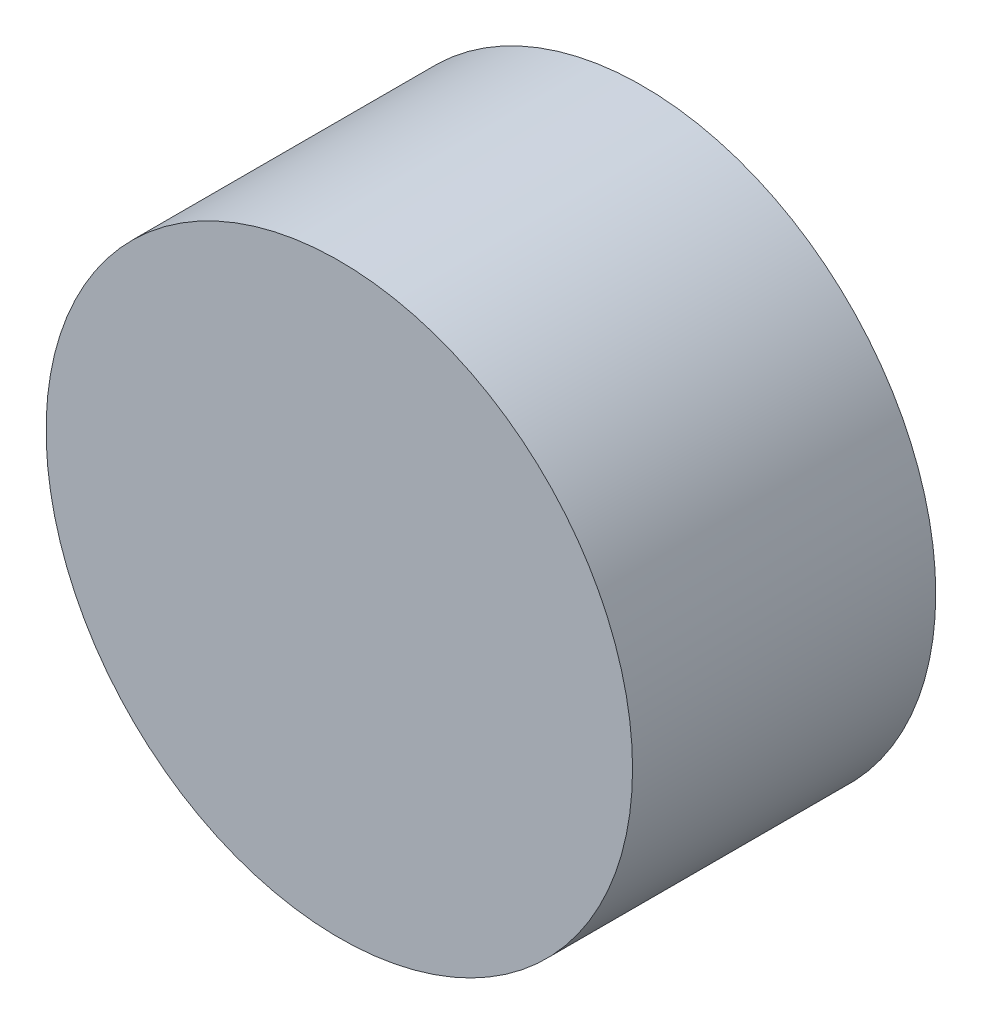
ISO-10303-21;
HEADER;
FILE_DESCRIPTION(('STEP AP214'),'2;1');
FILE_NAME('part.step','',(''),(''),'','','');
FILE_SCHEMA(('AUTOMOTIVE_DESIGN { 1 0 10303 214 1 1 1 1 }'));
ENDSEC;
DATA;
#1=APPLICATION_CONTEXT('core data for automotive mechanical design processes');
#2=APPLICATION_PROTOCOL_DEFINITION('international standard','automotive_design',2000,#1);
#3=PRODUCT_CONTEXT('',#1,'mechanical');
#4=PRODUCT('Part','Part','',(#3));
#5=PRODUCT_RELATED_PRODUCT_CATEGORY('part','',(#4));
#6=PRODUCT_DEFINITION_FORMATION('','',#4);
#7=PRODUCT_DEFINITION_CONTEXT('part definition',#1,'design');
#8=PRODUCT_DEFINITION('design','',#6,#7);
#9=PRODUCT_DEFINITION_SHAPE('','',#8);
#10=(LENGTH_UNIT() NAMED_UNIT(*) SI_UNIT(.MILLI.,.METRE.));
#11=(NAMED_UNIT(*) PLANE_ANGLE_UNIT() SI_UNIT($,.RADIAN.));
#12=(NAMED_UNIT(*) SI_UNIT($,.STERADIAN.) SOLID_ANGLE_UNIT());
#13=UNCERTAINTY_MEASURE_WITH_UNIT(LENGTH_MEASURE(1.E-05),#10,'distance_accuracy_value','');
#14=(GEOMETRIC_REPRESENTATION_CONTEXT(3) GLOBAL_UNCERTAINTY_ASSIGNED_CONTEXT((#13)) GLOBAL_UNIT_ASSIGNED_CONTEXT((#10,
#11,#12)) REPRESENTATION_CONTEXT('',''));
#15=CARTESIAN_POINT('',(0.,0.,0.));
#16=DIRECTION('',(0.,0.,1.));
#17=DIRECTION('',(1.,0.,0.));
#18=AXIS2_PLACEMENT_3D('',#15,#16,#17);
#19=CARTESIAN_POINT('',(0.,0.,15.25));
#20=DIRECTION('',(0.,0.,-1.));
#21=DIRECTION('',(-1.,0.,0.));
#22=AXIS2_PLACEMENT_3D('',#19,#20,#21);
#23=CYLINDRICAL_SURFACE('',#22,14.75);
#24=CARTESIAN_POINT('',(0.,0.,15.25));
#25=DIRECTION('',(0.,0.,1.));
#26=DIRECTION('',(1.,0.,0.));
#27=AXIS2_PLACEMENT_3D('',#24,#25,#26);
#28=CIRCLE('',#27,14.75);
#29=CARTESIAN_POINT('',(14.75,0.,15.25));
#30=VERTEX_POINT('',#29);
#31=EDGE_CURVE('E10',#30,#30,#28,.T.);
#32=ORIENTED_EDGE('',*,*,#31,.F.);
#33=EDGE_LOOP('',(#32));
#34=FACE_BOUND('',#33,.T.);
#35=CARTESIAN_POINT('',(0.,0.,0.));
#36=DIRECTION('',(0.,0.,1.));
#37=DIRECTION('',(1.,0.,0.));
#38=AXIS2_PLACEMENT_3D('',#35,#36,#37);
#39=CIRCLE('',#38,14.75);
#40=CARTESIAN_POINT('',(14.75,0.,0.));
#41=VERTEX_POINT('',#40);
#42=EDGE_CURVE('E34',#41,#41,#39,.T.);
#43=ORIENTED_EDGE('',*,*,#42,.T.);
#44=EDGE_LOOP('',(#43));
#45=FACE_BOUND('',#44,.T.);
#46=ADVANCED_FACE('F31',(#34,#45),#23,.T.);
#47=CARTESIAN_POINT('',(0.,0.,15.25));
#48=DIRECTION('',(0.,0.,1.));
#49=DIRECTION('',(1.,0.,0.));
#50=AXIS2_PLACEMENT_3D('',#47,#48,#49);
#51=PLANE('',#50);
#52=ORIENTED_EDGE('',*,*,#31,.T.);
#53=EDGE_LOOP('',(#52));
#54=FACE_BOUND('',#53,.T.);
#55=ADVANCED_FACE('F46',(#54),#51,.T.);
#56=CARTESIAN_POINT('',(0.,0.,0.));
#57=DIRECTION('',(0.,0.,1.));
#58=DIRECTION('',(1.,0.,0.));
#59=AXIS2_PLACEMENT_3D('',#56,#57,#58);
#60=PLANE('',#59);
#61=ORIENTED_EDGE('',*,*,#42,.F.);
#62=EDGE_LOOP('',(#61));
#63=FACE_BOUND('',#62,.T.);
#64=ADVANCED_FACE('F44',(#63),#60,.F.);
#65=CLOSED_SHELL('',(#46,#55,#64));
#66=MANIFOLD_SOLID_BREP('B2',#65);
#67=ADVANCED_BREP_SHAPE_REPRESENTATION('',(#18,#66),#14);
#68=SHAPE_DEFINITION_REPRESENTATION(#9,#67);
ENDSEC;
END-ISO-10303-21;
